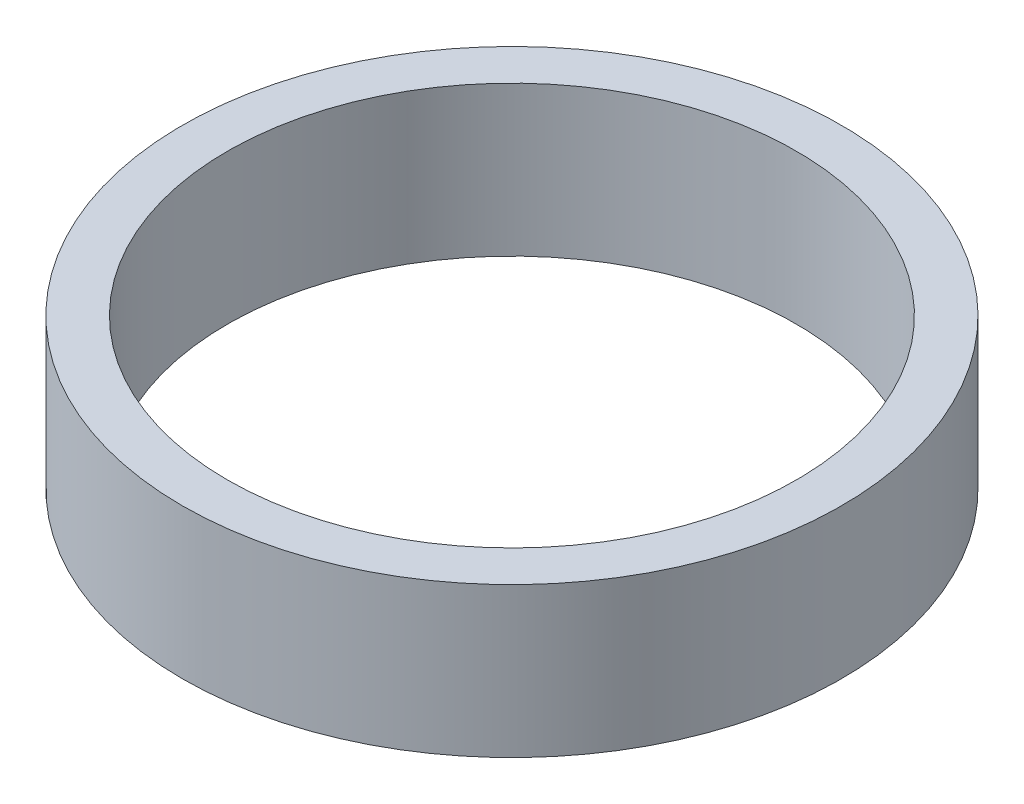
ISO-10303-21;
HEADER;
FILE_DESCRIPTION(('STEP AP214'),'2;1');
FILE_NAME('part.step','',(''),(''),'','','');
FILE_SCHEMA(('AUTOMOTIVE_DESIGN { 1 0 10303 214 1 1 1 1 }'));
ENDSEC;
DATA;
#1=APPLICATION_CONTEXT('core data for automotive mechanical design processes');
#2=APPLICATION_PROTOCOL_DEFINITION('international standard','automotive_design',2000,#1);
#3=PRODUCT_CONTEXT('',#1,'mechanical');
#4=PRODUCT('Part','Part','',(#3));
#5=PRODUCT_RELATED_PRODUCT_CATEGORY('part','',(#4));
#6=PRODUCT_DEFINITION_FORMATION('','',#4);
#7=PRODUCT_DEFINITION_CONTEXT('part definition',#1,'design');
#8=PRODUCT_DEFINITION('design','',#6,#7);
#9=PRODUCT_DEFINITION_SHAPE('','',#8);
#10=(LENGTH_UNIT() NAMED_UNIT(*) SI_UNIT(.MILLI.,.METRE.));
#11=(NAMED_UNIT(*) PLANE_ANGLE_UNIT() SI_UNIT($,.RADIAN.));
#12=(NAMED_UNIT(*) SI_UNIT($,.STERADIAN.) SOLID_ANGLE_UNIT());
#13=UNCERTAINTY_MEASURE_WITH_UNIT(LENGTH_MEASURE(1.E-05),#10,'distance_accuracy_value','');
#14=(GEOMETRIC_REPRESENTATION_CONTEXT(3) GLOBAL_UNCERTAINTY_ASSIGNED_CONTEXT((#13)) GLOBAL_UNIT_ASSIGNED_CONTEXT((#10,
#11,#12)) REPRESENTATION_CONTEXT('',''));
#15=CARTESIAN_POINT('',(0.,0.,0.));
#16=DIRECTION('',(0.,0.,1.));
#17=DIRECTION('',(1.,0.,0.));
#18=AXIS2_PLACEMENT_3D('',#15,#16,#17);
#19=CARTESIAN_POINT('',(0.,25.,0.));
#20=DIRECTION('',(0.,-1.,0.));
#21=DIRECTION('',(0.,0.,-1.));
#22=AXIS2_PLACEMENT_3D('',#19,#20,#21);
#23=CYLINDRICAL_SURFACE('',#22,55.);
#24=CARTESIAN_POINT('',(0.,25.,0.));
#25=DIRECTION('',(0.,1.,0.));
#26=DIRECTION('',(0.,0.,1.));
#27=AXIS2_PLACEMENT_3D('',#24,#25,#26);
#28=CIRCLE('',#27,55.);
#29=CARTESIAN_POINT('',(0.,25.,55.));
#30=VERTEX_POINT('',#29);
#31=EDGE_CURVE('E10',#30,#30,#28,.T.);
#32=ORIENTED_EDGE('',*,*,#31,.F.);
#33=EDGE_LOOP('',(#32));
#34=FACE_BOUND('',#33,.T.);
#35=CARTESIAN_POINT('',(0.,0.,0.));
#36=DIRECTION('',(0.,1.,0.));
#37=DIRECTION('',(0.,0.,1.));
#38=AXIS2_PLACEMENT_3D('',#35,#36,#37);
#39=CIRCLE('',#38,55.);
#40=CARTESIAN_POINT('',(0.,0.,55.));
#41=VERTEX_POINT('',#40);
#42=EDGE_CURVE('E37',#41,#41,#39,.T.);
#43=ORIENTED_EDGE('',*,*,#42,.T.);
#44=EDGE_LOOP('',(#43));
#45=FACE_BOUND('',#44,.T.);
#46=ADVANCED_FACE('F40',(#34,#45),#23,.T.);
#47=CARTESIAN_POINT('',(0.,25.,0.));
#48=DIRECTION('',(0.,1.,0.));
#49=DIRECTION('',(0.,0.,1.));
#50=AXIS2_PLACEMENT_3D('',#47,#48,#49);
#51=PLANE('',#50);
#52=CARTESIAN_POINT('',(0.,25.,0.));
#53=DIRECTION('',(0.,1.,0.));
#54=DIRECTION('',(0.,0.,1.));
#55=AXIS2_PLACEMENT_3D('',#52,#53,#54);
#56=CIRCLE('',#55,47.5);
#57=CARTESIAN_POINT('',(0.,25.,47.5));
#58=VERTEX_POINT('',#57);
#59=EDGE_CURVE('E50',#58,#58,#56,.T.);
#60=ORIENTED_EDGE('',*,*,#59,.F.);
#61=EDGE_LOOP('',(#60));
#62=FACE_BOUND('',#61,.T.);
#63=ORIENTED_EDGE('',*,*,#31,.T.);
#64=EDGE_LOOP('',(#63));
#65=FACE_BOUND('',#64,.T.);
#66=ADVANCED_FACE('F59',(#62,#65),#51,.T.);
#67=CARTESIAN_POINT('',(0.,0.,0.));
#68=DIRECTION('',(0.,1.,0.));
#69=DIRECTION('',(0.,0.,1.));
#70=AXIS2_PLACEMENT_3D('',#67,#68,#69);
#71=PLANE('',#70);
#72=CARTESIAN_POINT('',(0.,0.,0.));
#73=DIRECTION('',(0.,1.,0.));
#74=DIRECTION('',(0.,0.,1.));
#75=AXIS2_PLACEMENT_3D('',#72,#73,#74);
#76=CIRCLE('',#75,47.5);
#77=CARTESIAN_POINT('',(0.,0.,47.5));
#78=VERTEX_POINT('',#77);
#79=EDGE_CURVE('E47',#78,#78,#76,.T.);
#80=ORIENTED_EDGE('',*,*,#79,.T.);
#81=EDGE_LOOP('',(#80));
#82=FACE_BOUND('',#81,.T.);
#83=ORIENTED_EDGE('',*,*,#42,.F.);
#84=EDGE_LOOP('',(#83));
#85=FACE_BOUND('',#84,.T.);
#86=ADVANCED_FACE('F58',(#82,#85),#71,.F.);
#87=CARTESIAN_POINT('',(0.,25.,0.));
#88=DIRECTION('',(0.,-1.,0.));
#89=DIRECTION('',(0.,0.,-1.));
#90=AXIS2_PLACEMENT_3D('',#87,#88,#89);
#91=CYLINDRICAL_SURFACE('',#90,47.5);
#92=ORIENTED_EDGE('',*,*,#59,.T.);
#93=EDGE_LOOP('',(#92));
#94=FACE_BOUND('',#93,.T.);
#95=ORIENTED_EDGE('',*,*,#79,.F.);
#96=EDGE_LOOP('',(#95));
#97=FACE_BOUND('',#96,.T.);
#98=ADVANCED_FACE('F54',(#94,#97),#91,.F.);
#99=CLOSED_SHELL('',(#46,#66,#86,#98));
#100=MANIFOLD_SOLID_BREP('B2',#99);
#101=ADVANCED_BREP_SHAPE_REPRESENTATION('',(#18,#100),#14);
#102=SHAPE_DEFINITION_REPRESENTATION(#9,#101);
ENDSEC;
END-ISO-10303-21;
